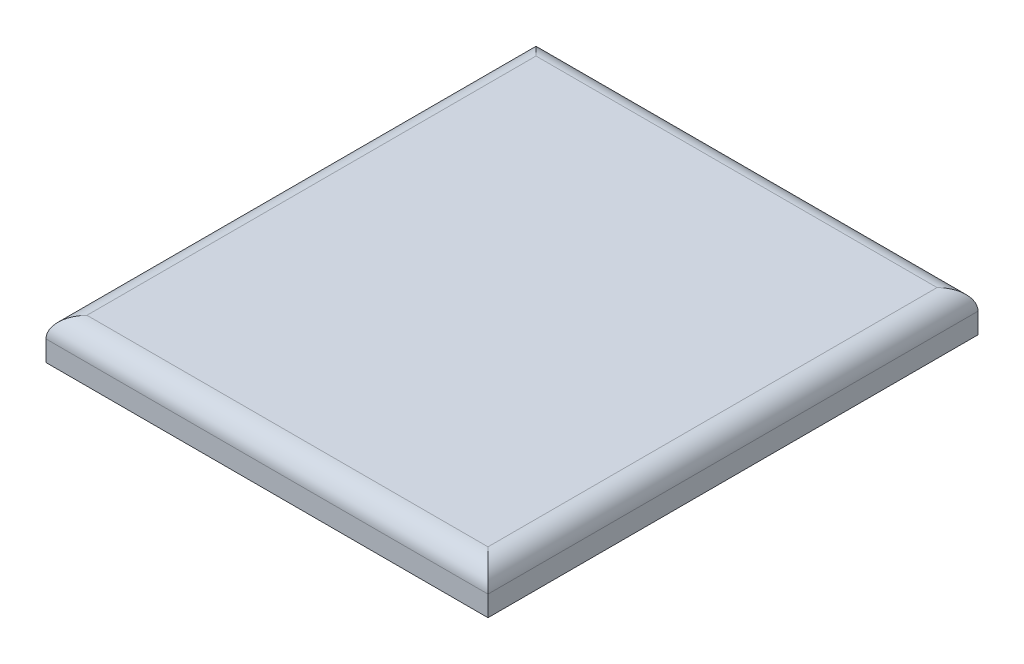
ISO-10303-21;
HEADER;
FILE_DESCRIPTION(('STEP AP214'),'2;1');
FILE_NAME('part.step','',(''),(''),'','','');
FILE_SCHEMA(('AUTOMOTIVE_DESIGN { 1 0 10303 214 1 1 1 1 }'));
ENDSEC;
DATA;
#1=APPLICATION_CONTEXT('core data for automotive mechanical design processes');
#2=APPLICATION_PROTOCOL_DEFINITION('international standard','automotive_design',2000,#1);
#3=PRODUCT_CONTEXT('',#1,'mechanical');
#4=PRODUCT('Part','Part','',(#3));
#5=PRODUCT_RELATED_PRODUCT_CATEGORY('part','',(#4));
#6=PRODUCT_DEFINITION_FORMATION('','',#4);
#7=PRODUCT_DEFINITION_CONTEXT('part definition',#1,'design');
#8=PRODUCT_DEFINITION('design','',#6,#7);
#9=PRODUCT_DEFINITION_SHAPE('','',#8);
#10=(LENGTH_UNIT() NAMED_UNIT(*) SI_UNIT(.MILLI.,.METRE.));
#11=(NAMED_UNIT(*) PLANE_ANGLE_UNIT() SI_UNIT($,.RADIAN.));
#12=(NAMED_UNIT(*) SI_UNIT($,.STERADIAN.) SOLID_ANGLE_UNIT());
#13=UNCERTAINTY_MEASURE_WITH_UNIT(LENGTH_MEASURE(1.E-05),#10,'distance_accuracy_value','');
#14=(GEOMETRIC_REPRESENTATION_CONTEXT(3) GLOBAL_UNCERTAINTY_ASSIGNED_CONTEXT((#13)) GLOBAL_UNIT_ASSIGNED_CONTEXT((#10,
#11,#12)) REPRESENTATION_CONTEXT('',''));
#15=CARTESIAN_POINT('',(0.,0.,0.));
#16=DIRECTION('',(0.,0.,1.));
#17=DIRECTION('',(1.,0.,0.));
#18=AXIS2_PLACEMENT_3D('',#15,#16,#17);
#19=CARTESIAN_POINT('',(215.9,40.,239.358222275241));
#20=DIRECTION('',(-1.,0.,0.));
#21=DIRECTION('',(0.,0.,1.));
#22=AXIS2_PLACEMENT_3D('',#19,#20,#21);
#23=PLANE('',#22);
#24=DIRECTION('',(0.,-1.,0.));
#25=VECTOR('',#24,1.);
#26=CARTESIAN_POINT('',(215.9,40.,-239.358222275241));
#27=LINE('',#26,#25);
#28=CARTESIAN_POINT('',(215.9,20.,-239.358222275241));
#29=VERTEX_POINT('',#28);
#30=CARTESIAN_POINT('',(215.9,0.,-239.358222275241));
#31=VERTEX_POINT('',#30);
#32=EDGE_CURVE('E97',#29,#31,#27,.T.);
#33=ORIENTED_EDGE('',*,*,#32,.F.);
#34=DIRECTION('',(0.,0.,-1.));
#35=VECTOR('',#34,1.);
#36=CARTESIAN_POINT('',(215.9,20.,239.358222275241));
#37=LINE('',#36,#35);
#38=CARTESIAN_POINT('',(215.9,20.,239.358222275241));
#39=VERTEX_POINT('',#38);
#40=EDGE_CURVE('E141',#29,#39,#37,.F.);
#41=ORIENTED_EDGE('',*,*,#40,.T.);
#42=DIRECTION('',(0.,-1.,0.));
#43=VECTOR('',#42,1.);
#44=CARTESIAN_POINT('',(215.9,40.,239.358222275241));
#45=LINE('',#44,#43);
#46=CARTESIAN_POINT('',(215.9,0.,239.358222275241));
#47=VERTEX_POINT('',#46);
#48=EDGE_CURVE('E117',#39,#47,#45,.T.);
#49=ORIENTED_EDGE('',*,*,#48,.T.);
#50=DIRECTION('',(0.,0.,-1.));
#51=VECTOR('',#50,1.);
#52=CARTESIAN_POINT('',(215.9,0.,239.358222275241));
#53=LINE('',#52,#51);
#54=EDGE_CURVE('E112',#47,#31,#53,.T.);
#55=ORIENTED_EDGE('',*,*,#54,.T.);
#56=EDGE_LOOP('',(#33,#41,#49,#55));
#57=FACE_BOUND('',#56,.T.);
#58=ADVANCED_FACE('F46',(#57),#23,.F.);
#59=CARTESIAN_POINT('',(-215.9,40.,-239.358222275241));
#60=DIRECTION('',(0.,0.,1.));
#61=DIRECTION('',(1.,0.,0.));
#62=AXIS2_PLACEMENT_3D('',#59,#60,#61);
#63=PLANE('',#62);
#64=DIRECTION('',(0.,-1.,0.));
#65=VECTOR('',#64,1.);
#66=CARTESIAN_POINT('',(-215.9,40.,-239.358222275241));
#67=LINE('',#66,#65);
#68=CARTESIAN_POINT('',(-215.9,20.,-239.358222275241));
#69=VERTEX_POINT('',#68);
#70=CARTESIAN_POINT('',(-215.9,0.,-239.358222275241));
#71=VERTEX_POINT('',#70);
#72=EDGE_CURVE('E106',#69,#71,#67,.T.);
#73=ORIENTED_EDGE('',*,*,#72,.F.);
#74=DIRECTION('',(-1.,0.,0.));
#75=VECTOR('',#74,1.);
#76=CARTESIAN_POINT('',(-215.9,20.,-239.358222275241));
#77=LINE('',#76,#75);
#78=EDGE_CURVE('E55',#69,#29,#77,.F.);
#79=ORIENTED_EDGE('',*,*,#78,.T.);
#80=ORIENTED_EDGE('',*,*,#32,.T.);
#81=DIRECTION('',(-1.,0.,0.));
#82=VECTOR('',#81,1.);
#83=CARTESIAN_POINT('',(-215.9,0.,-239.358222275241));
#84=LINE('',#83,#82);
#85=EDGE_CURVE('E100',#31,#71,#84,.T.);
#86=ORIENTED_EDGE('',*,*,#85,.T.);
#87=EDGE_LOOP('',(#73,#79,#80,#86));
#88=FACE_BOUND('',#87,.T.);
#89=ADVANCED_FACE('F99',(#88),#63,.F.);
#90=CARTESIAN_POINT('',(-215.9,40.,239.358222275241));
#91=DIRECTION('',(1.,0.,0.));
#92=DIRECTION('',(0.,0.,-1.));
#93=AXIS2_PLACEMENT_3D('',#90,#91,#92);
#94=PLANE('',#93);
#95=DIRECTION('',(0.,-1.,0.));
#96=VECTOR('',#95,1.);
#97=CARTESIAN_POINT('',(-215.9,40.,239.358222275241));
#98=LINE('',#97,#96);
#99=CARTESIAN_POINT('',(-215.9,20.,239.358222275241));
#100=VERTEX_POINT('',#99);
#101=CARTESIAN_POINT('',(-215.9,0.,239.358222275241));
#102=VERTEX_POINT('',#101);
#103=EDGE_CURVE('E127',#100,#102,#98,.T.);
#104=ORIENTED_EDGE('',*,*,#103,.F.);
#105=DIRECTION('',(0.,0.,1.));
#106=VECTOR('',#105,1.);
#107=CARTESIAN_POINT('',(-215.9,20.,239.358222275241));
#108=LINE('',#107,#106);
#109=EDGE_CURVE('E13',#100,#69,#108,.F.);
#110=ORIENTED_EDGE('',*,*,#109,.T.);
#111=ORIENTED_EDGE('',*,*,#72,.T.);
#112=DIRECTION('',(0.,0.,1.));
#113=VECTOR('',#112,1.);
#114=CARTESIAN_POINT('',(-215.9,0.,239.358222275241));
#115=LINE('',#114,#113);
#116=EDGE_CURVE('E114',#71,#102,#115,.T.);
#117=ORIENTED_EDGE('',*,*,#116,.T.);
#118=EDGE_LOOP('',(#104,#110,#111,#117));
#119=FACE_BOUND('',#118,.T.);
#120=ADVANCED_FACE('F166',(#119),#94,.F.);
#121=CARTESIAN_POINT('',(-215.9,40.,239.358222275241));
#122=DIRECTION('',(0.,0.,-1.));
#123=DIRECTION('',(-1.,0.,0.));
#124=AXIS2_PLACEMENT_3D('',#121,#122,#123);
#125=PLANE('',#124);
#126=ORIENTED_EDGE('',*,*,#48,.F.);
#127=DIRECTION('',(1.,0.,0.));
#128=VECTOR('',#127,1.);
#129=CARTESIAN_POINT('',(-215.9,20.,239.358222275241));
#130=LINE('',#129,#128);
#131=EDGE_CURVE('E138',#39,#100,#130,.F.);
#132=ORIENTED_EDGE('',*,*,#131,.T.);
#133=ORIENTED_EDGE('',*,*,#103,.T.);
#134=DIRECTION('',(1.,0.,0.));
#135=VECTOR('',#134,1.);
#136=CARTESIAN_POINT('',(-215.9,0.,239.358222275241));
#137=LINE('',#136,#135);
#138=EDGE_CURVE('E124',#102,#47,#137,.T.);
#139=ORIENTED_EDGE('',*,*,#138,.T.);
#140=EDGE_LOOP('',(#126,#132,#133,#139));
#141=FACE_BOUND('',#140,.T.);
#142=ADVANCED_FACE('F165',(#141),#125,.F.);
#143=CARTESIAN_POINT('',(0.,40.,0.));
#144=DIRECTION('',(0.,-1.,0.));
#145=DIRECTION('',(0.,0.,-1.));
#146=AXIS2_PLACEMENT_3D('',#143,#144,#145);
#147=PLANE('',#146);
#148=DIRECTION('',(0.,0.,1.));
#149=VECTOR('',#148,1.);
#150=CARTESIAN_POINT('',(-195.9,40.,0.));
#151=LINE('',#150,#149);
#152=CARTESIAN_POINT('',(-195.9,40.,-219.358222275241));
#153=VERTEX_POINT('',#152);
#154=CARTESIAN_POINT('',(-195.9,40.,219.358222275241));
#155=VERTEX_POINT('',#154);
#156=EDGE_CURVE('E105',#153,#155,#151,.T.);
#157=ORIENTED_EDGE('',*,*,#156,.T.);
#158=DIRECTION('',(1.,0.,0.));
#159=VECTOR('',#158,1.);
#160=CARTESIAN_POINT('',(0.,40.,219.358222275241));
#161=LINE('',#160,#159);
#162=CARTESIAN_POINT('',(195.9,40.,219.358222275241));
#163=VERTEX_POINT('',#162);
#164=EDGE_CURVE('E135',#155,#163,#161,.T.);
#165=ORIENTED_EDGE('',*,*,#164,.T.);
#166=DIRECTION('',(0.,0.,-1.));
#167=VECTOR('',#166,1.);
#168=CARTESIAN_POINT('',(195.9,40.,0.));
#169=LINE('',#168,#167);
#170=CARTESIAN_POINT('',(195.9,40.,-219.358222275241));
#171=VERTEX_POINT('',#170);
#172=EDGE_CURVE('E133',#163,#171,#169,.T.);
#173=ORIENTED_EDGE('',*,*,#172,.T.);
#174=DIRECTION('',(-1.,0.,0.));
#175=VECTOR('',#174,1.);
#176=CARTESIAN_POINT('',(0.,40.,-219.358222275241));
#177=LINE('',#176,#175);
#178=EDGE_CURVE('E131',#171,#153,#177,.T.);
#179=ORIENTED_EDGE('',*,*,#178,.T.);
#180=EDGE_LOOP('',(#157,#165,#173,#179));
#181=FACE_BOUND('',#180,.T.);
#182=ADVANCED_FACE('F158',(#181),#147,.F.);
#183=CARTESIAN_POINT('',(0.,0.,0.));
#184=DIRECTION('',(0.,-1.,0.));
#185=DIRECTION('',(0.,0.,-1.));
#186=AXIS2_PLACEMENT_3D('',#183,#184,#185);
#187=PLANE('',#186);
#188=ORIENTED_EDGE('',*,*,#54,.F.);
#189=ORIENTED_EDGE('',*,*,#138,.F.);
#190=ORIENTED_EDGE('',*,*,#116,.F.);
#191=ORIENTED_EDGE('',*,*,#85,.F.);
#192=EDGE_LOOP('',(#188,#189,#190,#191));
#193=FACE_BOUND('',#192,.T.);
#194=ADVANCED_FACE('F110',(#193),#187,.T.);
#195=CARTESIAN_POINT('',(0.,20.,-219.358222275241));
#196=DIRECTION('',(-1.,0.,0.));
#197=DIRECTION('',(0.,0.,1.));
#198=AXIS2_PLACEMENT_3D('',#195,#196,#197);
#199=CYLINDRICAL_SURFACE('',#198,20.);
#200=CARTESIAN_POINT('',(195.9,20.,-219.358222275241));
#201=DIRECTION('',(-0.707106781186547,0.,-0.707106781186547));
#202=DIRECTION('',(-0.707106781186547,0.,0.707106781186547));
#203=AXIS2_PLACEMENT_3D('',#200,#201,#202);
#204=ELLIPSE('',#203,28.2842712474619,20.);
#205=EDGE_CURVE('E121',#29,#171,#204,.F.);
#206=ORIENTED_EDGE('',*,*,#205,.F.);
#207=ORIENTED_EDGE('',*,*,#78,.F.);
#208=CARTESIAN_POINT('',(-195.9,20.,-219.358222275241));
#209=DIRECTION('',(-0.707106781186547,0.,0.707106781186547));
#210=DIRECTION('',(0.707106781186547,0.,0.707106781186547));
#211=AXIS2_PLACEMENT_3D('',#208,#209,#210);
#212=ELLIPSE('',#211,28.2842712474619,20.);
#213=EDGE_CURVE('E50',#153,#69,#212,.T.);
#214=ORIENTED_EDGE('',*,*,#213,.F.);
#215=ORIENTED_EDGE('',*,*,#178,.F.);
#216=EDGE_LOOP('',(#206,#207,#214,#215));
#217=FACE_BOUND('',#216,.T.);
#218=ADVANCED_FACE('F48',(#217),#199,.T.);
#219=CARTESIAN_POINT('',(-195.9,20.,0.));
#220=DIRECTION('',(0.,0.,1.));
#221=DIRECTION('',(1.,0.,0.));
#222=AXIS2_PLACEMENT_3D('',#219,#220,#221);
#223=CYLINDRICAL_SURFACE('',#222,20.);
#224=ORIENTED_EDGE('',*,*,#213,.T.);
#225=ORIENTED_EDGE('',*,*,#109,.F.);
#226=CARTESIAN_POINT('',(-195.9,20.,219.358222275241));
#227=DIRECTION('',(0.707106781186547,0.,0.707106781186547));
#228=DIRECTION('',(-0.707106781186547,0.,0.707106781186547));
#229=AXIS2_PLACEMENT_3D('',#226,#227,#228);
#230=ELLIPSE('',#229,28.2842712474619,20.);
#231=EDGE_CURVE('E146',#155,#100,#230,.T.);
#232=ORIENTED_EDGE('',*,*,#231,.F.);
#233=ORIENTED_EDGE('',*,*,#156,.F.);
#234=EDGE_LOOP('',(#224,#225,#232,#233));
#235=FACE_BOUND('',#234,.T.);
#236=ADVANCED_FACE('F183',(#235),#223,.T.);
#237=CARTESIAN_POINT('',(195.9,20.,0.));
#238=DIRECTION('',(0.,0.,-1.));
#239=DIRECTION('',(-1.,0.,0.));
#240=AXIS2_PLACEMENT_3D('',#237,#238,#239);
#241=CYLINDRICAL_SURFACE('',#240,20.);
#242=ORIENTED_EDGE('',*,*,#205,.T.);
#243=ORIENTED_EDGE('',*,*,#172,.F.);
#244=CARTESIAN_POINT('',(195.9,20.,219.358222275241));
#245=DIRECTION('',(0.707106781186547,0.,-0.707106781186547));
#246=DIRECTION('',(-0.707106781186547,0.,-0.707106781186547));
#247=AXIS2_PLACEMENT_3D('',#244,#245,#246);
#248=ELLIPSE('',#247,28.2842712474619,20.);
#249=EDGE_CURVE('E144',#39,#163,#248,.F.);
#250=ORIENTED_EDGE('',*,*,#249,.F.);
#251=ORIENTED_EDGE('',*,*,#40,.F.);
#252=EDGE_LOOP('',(#242,#243,#250,#251));
#253=FACE_BOUND('',#252,.T.);
#254=ADVANCED_FACE('F151',(#253),#241,.T.);
#255=CARTESIAN_POINT('',(0.,20.,219.358222275241));
#256=DIRECTION('',(1.,0.,0.));
#257=DIRECTION('',(0.,0.,-1.));
#258=AXIS2_PLACEMENT_3D('',#255,#256,#257);
#259=CYLINDRICAL_SURFACE('',#258,20.);
#260=ORIENTED_EDGE('',*,*,#231,.T.);
#261=ORIENTED_EDGE('',*,*,#131,.F.);
#262=ORIENTED_EDGE('',*,*,#249,.T.);
#263=ORIENTED_EDGE('',*,*,#164,.F.);
#264=EDGE_LOOP('',(#260,#261,#262,#263));
#265=FACE_BOUND('',#264,.T.);
#266=ADVANCED_FACE('F162',(#265),#259,.T.);
#267=CLOSED_SHELL('',(#58,#89,#120,#142,#182,#194,#218,#236,#254,#266));
#268=MANIFOLD_SOLID_BREP('B2',#267);
#269=ADVANCED_BREP_SHAPE_REPRESENTATION('',(#18,#268),#14);
#270=SHAPE_DEFINITION_REPRESENTATION(#9,#269);
ENDSEC;
END-ISO-10303-21;
